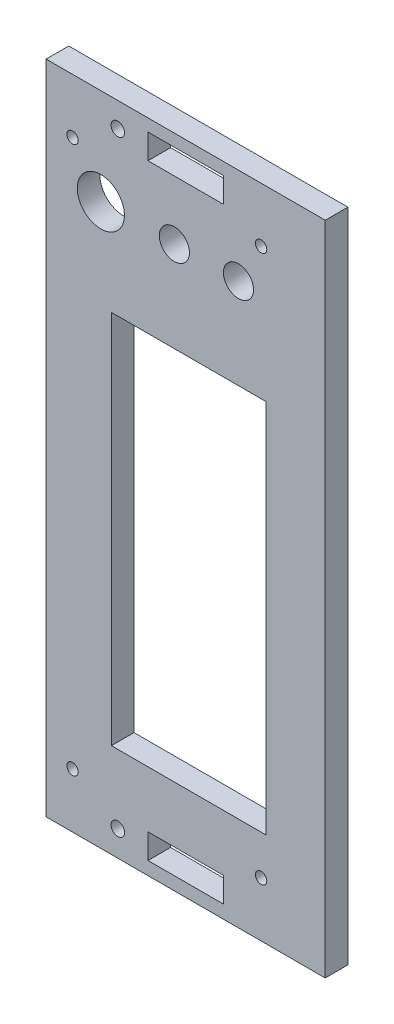
ISO-10303-21;
HEADER;
FILE_DESCRIPTION(('STEP AP214'),'2;1');
FILE_NAME('part.step','',(''),(''),'','','');
FILE_SCHEMA(('AUTOMOTIVE_DESIGN { 1 0 10303 214 1 1 1 1 }'));
ENDSEC;
DATA;
#1=APPLICATION_CONTEXT('core data for automotive mechanical design processes');
#2=APPLICATION_PROTOCOL_DEFINITION('international standard','automotive_design',2000,#1);
#3=PRODUCT_CONTEXT('',#1,'mechanical');
#4=PRODUCT('Part','Part','',(#3));
#5=PRODUCT_RELATED_PRODUCT_CATEGORY('part','',(#4));
#6=PRODUCT_DEFINITION_FORMATION('','',#4);
#7=PRODUCT_DEFINITION_CONTEXT('part definition',#1,'design');
#8=PRODUCT_DEFINITION('design','',#6,#7);
#9=PRODUCT_DEFINITION_SHAPE('','',#8);
#10=(LENGTH_UNIT() NAMED_UNIT(*) SI_UNIT(.MILLI.,.METRE.));
#11=(NAMED_UNIT(*) PLANE_ANGLE_UNIT() SI_UNIT($,.RADIAN.));
#12=(NAMED_UNIT(*) SI_UNIT($,.STERADIAN.) SOLID_ANGLE_UNIT());
#13=UNCERTAINTY_MEASURE_WITH_UNIT(LENGTH_MEASURE(1.E-05),#10,'distance_accuracy_value','');
#14=(GEOMETRIC_REPRESENTATION_CONTEXT(3) GLOBAL_UNCERTAINTY_ASSIGNED_CONTEXT((#13)) GLOBAL_UNIT_ASSIGNED_CONTEXT((#10,
#11,#12)) REPRESENTATION_CONTEXT('',''));
#15=CARTESIAN_POINT('',(0.,0.,0.));
#16=DIRECTION('',(0.,0.,1.));
#17=DIRECTION('',(1.,0.,0.));
#18=AXIS2_PLACEMENT_3D('',#15,#16,#17);
#19=CARTESIAN_POINT('',(0.,0.,6.));
#20=DIRECTION('',(0.,0.,1.));
#21=DIRECTION('',(1.,0.,0.));
#22=AXIS2_PLACEMENT_3D('',#19,#20,#21);
#23=PLANE('',#22);
#24=CARTESIAN_POINT('',(37.8220167653481,166.853545558465,6.));
#25=DIRECTION('',(0.,0.,1.));
#26=DIRECTION('',(1.,0.,0.));
#27=AXIS2_PLACEMENT_3D('',#24,#25,#26);
#28=CIRCLE('',#27,1.49999987999985);
#29=CARTESIAN_POINT('',(39.3220166453479,166.853545558465,6.));
#30=VERTEX_POINT('',#29);
#31=EDGE_CURVE('E255',#30,#30,#28,.T.);
#32=ORIENTED_EDGE('',*,*,#31,.F.);
#33=EDGE_LOOP('',(#32));
#34=FACE_BOUND('',#33,.T.);
#35=CARTESIAN_POINT('',(64.8220146053483,155.853546358465,6.));
#36=DIRECTION('',(0.,0.,1.));
#37=DIRECTION('',(1.,0.,0.));
#38=AXIS2_PLACEMENT_3D('',#35,#36,#37);
#39=CIRCLE('',#38,3.99999968000003);
#40=CARTESIAN_POINT('',(68.8220142853483,155.853546358465,6.));
#41=VERTEX_POINT('',#40);
#42=EDGE_CURVE('E267',#41,#41,#39,.T.);
#43=ORIENTED_EDGE('',*,*,#42,.F.);
#44=EDGE_LOOP('',(#43));
#45=FACE_BOUND('',#44,.T.);
#46=CARTESIAN_POINT('',(87.8220127653485,166.853545558465,6.));
#47=DIRECTION('',(0.,0.,1.));
#48=DIRECTION('',(1.,0.,0.));
#49=AXIS2_PLACEMENT_3D('',#46,#47,#48);
#50=CIRCLE('',#49,1.49999987999982);
#51=CARTESIAN_POINT('',(89.3220126453483,166.853545558465,6.));
#52=VERTEX_POINT('',#51);
#53=EDGE_CURVE('E279',#52,#52,#50,.T.);
#54=ORIENTED_EDGE('',*,*,#53,.F.);
#55=EDGE_LOOP('',(#54));
#56=FACE_BOUND('',#55,.T.);
#57=CARTESIAN_POINT('',(49.8220158053478,14.1317550915959,6.));
#58=DIRECTION('',(0.,0.,1.));
#59=DIRECTION('',(1.,0.,0.));
#60=AXIS2_PLACEMENT_3D('',#57,#58,#59);
#61=CIRCLE('',#60,1.79999985600005);
#62=CARTESIAN_POINT('',(51.6220156613478,14.1317550915959,6.));
#63=VERTEX_POINT('',#62);
#64=EDGE_CURVE('E291',#63,#63,#61,.T.);
#65=ORIENTED_EDGE('',*,*,#64,.F.);
#66=EDGE_LOOP('',(#65));
#67=FACE_BOUND('',#66,.T.);
#68=DIRECTION('',(-1.,0.,0.));
#69=VECTOR('',#68,1.);
#70=CARTESIAN_POINT('',(104.822011405349,181.353544398465,6.));
#71=LINE('',#70,#69);
#72=CARTESIAN_POINT('',(104.822011405349,181.353544398465,6.));
#73=VERTEX_POINT('',#72);
#74=CARTESIAN_POINT('',(30.822017325348,181.353544398465,6.));
#75=VERTEX_POINT('',#74);
#76=EDGE_CURVE('E303',#73,#75,#71,.T.);
#77=ORIENTED_EDGE('',*,*,#76,.T.);
#78=DIRECTION('',(0.,-1.,0.));
#79=VECTOR('',#78,1.);
#80=CARTESIAN_POINT('',(30.822017325348,181.353544398465,6.));
#81=LINE('',#80,#79);
#82=CARTESIAN_POINT('',(30.8220173253477,7.35355831846411,6.));
#83=VERTEX_POINT('',#82);
#84=EDGE_CURVE('E306',#75,#83,#81,.T.);
#85=ORIENTED_EDGE('',*,*,#84,.T.);
#86=DIRECTION('',(1.,0.,0.));
#87=VECTOR('',#86,1.);
#88=CARTESIAN_POINT('',(30.8220173253477,7.35355831846411,6.));
#89=LINE('',#88,#87);
#90=CARTESIAN_POINT('',(104.822011405348,7.35355831846394,6.));
#91=VERTEX_POINT('',#90);
#92=EDGE_CURVE('E309',#83,#91,#89,.T.);
#93=ORIENTED_EDGE('',*,*,#92,.T.);
#94=DIRECTION('',(0.,1.,0.));
#95=VECTOR('',#94,1.);
#96=CARTESIAN_POINT('',(104.822011405348,7.35355831846394,6.));
#97=LINE('',#96,#95);
#98=EDGE_CURVE('E311',#91,#73,#97,.T.);
#99=ORIENTED_EDGE('',*,*,#98,.T.);
#100=EDGE_LOOP('',(#77,#85,#93,#99));
#101=FACE_BOUND('',#100,.T.);
#102=CARTESIAN_POINT('',(87.8220127653481,21.8535571584638,6.));
#103=DIRECTION('',(0.,0.,1.));
#104=DIRECTION('',(1.,0.,0.));
#105=AXIS2_PLACEMENT_3D('',#102,#103,#104);
#106=CIRCLE('',#105,1.5);
#107=CARTESIAN_POINT('',(89.3220127653481,21.8535571584638,6.));
#108=VERTEX_POINT('',#107);
#109=EDGE_CURVE('E297',#108,#108,#106,.T.);
#110=ORIENTED_EDGE('',*,*,#109,.F.);
#111=EDGE_LOOP('',(#110));
#112=FACE_BOUND('',#111,.T.);
#113=CARTESIAN_POINT('',(37.8220167653477,21.8535571584639,6.));
#114=DIRECTION('',(0.,0.,1.));
#115=DIRECTION('',(1.,0.,0.));
#116=AXIS2_PLACEMENT_3D('',#113,#114,#115);
#117=CIRCLE('',#116,1.49999988000003);
#118=CARTESIAN_POINT('',(39.3220166453478,21.8535571584639,6.));
#119=VERTEX_POINT('',#118);
#120=EDGE_CURVE('E285',#119,#119,#117,.T.);
#121=ORIENTED_EDGE('',*,*,#120,.F.);
#122=EDGE_LOOP('',(#121));
#123=FACE_BOUND('',#122,.T.);
#124=CARTESIAN_POINT('',(81.8220132453484,155.853546358465,6.));
#125=DIRECTION('',(0.,0.,1.));
#126=DIRECTION('',(1.,0.,0.));
#127=AXIS2_PLACEMENT_3D('',#124,#125,#126);
#128=CIRCLE('',#127,3.99999968);
#129=CARTESIAN_POINT('',(85.8220129253484,155.853546358465,6.));
#130=VERTEX_POINT('',#129);
#131=EDGE_CURVE('E273',#130,#130,#128,.T.);
#132=ORIENTED_EDGE('',*,*,#131,.F.);
#133=EDGE_LOOP('',(#132));
#134=FACE_BOUND('',#133,.T.);
#135=CARTESIAN_POINT('',(45.3220161653481,155.853546358465,6.));
#136=DIRECTION('',(0.,0.,1.));
#137=DIRECTION('',(1.,0.,0.));
#138=AXIS2_PLACEMENT_3D('',#135,#136,#137);
#139=CIRCLE('',#138,6.24999950000005);
#140=CARTESIAN_POINT('',(51.5720156653482,155.853546358465,6.));
#141=VERTEX_POINT('',#140);
#142=EDGE_CURVE('E261',#141,#141,#139,.T.);
#143=ORIENTED_EDGE('',*,*,#142,.F.);
#144=EDGE_LOOP('',(#143));
#145=FACE_BOUND('',#144,.T.);
#146=CARTESIAN_POINT('',(49.8220158053482,174.808809716546,6.));
#147=DIRECTION('',(0.,0.,1.));
#148=DIRECTION('',(1.,0.,0.));
#149=AXIS2_PLACEMENT_3D('',#146,#147,#148);
#150=CIRCLE('',#149,1.79999985599997);
#151=CARTESIAN_POINT('',(51.6220156613482,174.808809716546,6.));
#152=VERTEX_POINT('',#151);
#153=EDGE_CURVE('E249',#152,#152,#150,.T.);
#154=ORIENTED_EDGE('',*,*,#153,.F.);
#155=EDGE_LOOP('',(#154));
#156=FACE_BOUND('',#155,.T.);
#157=DIRECTION('',(-1.,0.,0.));
#158=VECTOR('',#157,1.);
#159=CARTESIAN_POINT('',(89.1220126613484,131.853548358465,6.));
#160=LINE('',#159,#158);
#161=CARTESIAN_POINT('',(89.1220126613484,131.853548358465,6.));
#162=VERTEX_POINT('',#161);
#163=CARTESIAN_POINT('',(48.122015941348,131.853548358465,6.));
#164=VERTEX_POINT('',#163);
#165=EDGE_CURVE('E220',#162,#164,#160,.T.);
#166=ORIENTED_EDGE('',*,*,#165,.F.);
#167=DIRECTION('',(0.,1.,0.));
#168=VECTOR('',#167,1.);
#169=CARTESIAN_POINT('',(89.1220126613482,32.3535563184641,6.));
#170=LINE('',#169,#168);
#171=CARTESIAN_POINT('',(89.1220126613482,32.3535563184641,6.));
#172=VERTEX_POINT('',#171);
#173=EDGE_CURVE('E218',#172,#162,#170,.T.);
#174=ORIENTED_EDGE('',*,*,#173,.F.);
#175=DIRECTION('',(1.,0.,0.));
#176=VECTOR('',#175,1.);
#177=CARTESIAN_POINT('',(48.1220159413478,32.3535563184641,6.));
#178=LINE('',#177,#176);
#179=CARTESIAN_POINT('',(48.1220159413478,32.3535563184641,6.));
#180=VERTEX_POINT('',#179);
#181=EDGE_CURVE('E226',#180,#172,#178,.T.);
#182=ORIENTED_EDGE('',*,*,#181,.F.);
#183=DIRECTION('',(0.,-1.,0.));
#184=VECTOR('',#183,1.);
#185=CARTESIAN_POINT('',(48.122015941348,131.853548358465,6.));
#186=LINE('',#185,#184);
#187=EDGE_CURVE('E223',#164,#180,#186,.T.);
#188=ORIENTED_EDGE('',*,*,#187,.F.);
#189=EDGE_LOOP('',(#166,#174,#182,#188));
#190=FACE_BOUND('',#189,.T.);
#191=DIRECTION('',(0.,-1.,0.));
#192=VECTOR('',#191,1.);
#193=CARTESIAN_POINT('',(57.8220172467975,17.4317557862455,6.));
#194=LINE('',#193,#192);
#195=CARTESIAN_POINT('',(57.8220172467975,17.4317557862455,6.));
#196=VERTEX_POINT('',#195);
#197=CARTESIAN_POINT('',(57.8220172467975,10.8317543969464,6.));
#198=VERTEX_POINT('',#197);
#199=EDGE_CURVE('E189',#196,#198,#194,.T.);
#200=ORIENTED_EDGE('',*,*,#199,.F.);
#201=DIRECTION('',(-1.,0.,0.));
#202=VECTOR('',#201,1.);
#203=CARTESIAN_POINT('',(77.8220114838981,17.4317557862455,6.));
#204=LINE('',#203,#202);
#205=CARTESIAN_POINT('',(77.8220114838981,17.4317557862455,6.));
#206=VERTEX_POINT('',#205);
#207=EDGE_CURVE('E187',#206,#196,#204,.T.);
#208=ORIENTED_EDGE('',*,*,#207,.F.);
#209=DIRECTION('',(0.,1.,0.));
#210=VECTOR('',#209,1.);
#211=CARTESIAN_POINT('',(77.8220114838984,10.8317543969464,6.));
#212=LINE('',#211,#210);
#213=CARTESIAN_POINT('',(77.8220114838984,10.8317543969464,6.));
#214=VERTEX_POINT('',#213);
#215=EDGE_CURVE('E195',#214,#206,#212,.T.);
#216=ORIENTED_EDGE('',*,*,#215,.F.);
#217=DIRECTION('',(1.,0.,0.));
#218=VECTOR('',#217,1.);
#219=CARTESIAN_POINT('',(57.8220172467975,10.8317543969464,6.));
#220=LINE('',#219,#218);
#221=EDGE_CURVE('E192',#198,#214,#220,.T.);
#222=ORIENTED_EDGE('',*,*,#221,.F.);
#223=EDGE_LOOP('',(#200,#208,#216,#222));
#224=FACE_BOUND('',#223,.T.);
#225=DIRECTION('',(0.,1.,0.));
#226=VECTOR('',#225,1.);
#227=CARTESIAN_POINT('',(77.8220114838988,171.508809021897,6.));
#228=LINE('',#227,#226);
#229=CARTESIAN_POINT('',(77.8220114838988,171.508809021897,6.));
#230=VERTEX_POINT('',#229);
#231=CARTESIAN_POINT('',(77.8220114838986,178.108810411196,6.));
#232=VERTEX_POINT('',#231);
#233=EDGE_CURVE('E159',#230,#232,#228,.T.);
#234=ORIENTED_EDGE('',*,*,#233,.F.);
#235=DIRECTION('',(1.,0.,0.));
#236=VECTOR('',#235,1.);
#237=CARTESIAN_POINT('',(57.8220172467981,171.508809021897,6.));
#238=LINE('',#237,#236);
#239=CARTESIAN_POINT('',(57.8220172467981,171.508809021897,6.));
#240=VERTEX_POINT('',#239);
#241=EDGE_CURVE('E151',#240,#230,#238,.T.);
#242=ORIENTED_EDGE('',*,*,#241,.F.);
#243=DIRECTION('',(0.,-1.,0.));
#244=VECTOR('',#243,1.);
#245=CARTESIAN_POINT('',(57.8220172467981,178.108810411196,6.));
#246=LINE('',#245,#244);
#247=CARTESIAN_POINT('',(57.8220172467981,178.108810411196,6.));
#248=VERTEX_POINT('',#247);
#249=EDGE_CURVE('E173',#248,#240,#246,.T.);
#250=ORIENTED_EDGE('',*,*,#249,.F.);
#251=DIRECTION('',(-1.,0.,0.));
#252=VECTOR('',#251,1.);
#253=CARTESIAN_POINT('',(77.8220114838986,178.108810411196,6.));
#254=LINE('',#253,#252);
#255=EDGE_CURVE('E171',#232,#248,#254,.T.);
#256=ORIENTED_EDGE('',*,*,#255,.F.);
#257=EDGE_LOOP('',(#234,#242,#250,#256));
#258=FACE_BOUND('',#257,.T.);
#259=ADVANCED_FACE('F38',(#34,#45,#56,#67,#101,#112,#123,#134,#145,#156,#190,#224,#258),#23,.T.);
#260=CARTESIAN_POINT('',(0.,0.,0.));
#261=DIRECTION('',(0.,0.,1.));
#262=DIRECTION('',(1.,0.,0.));
#263=AXIS2_PLACEMENT_3D('',#260,#261,#262);
#264=PLANE('',#263);
#265=DIRECTION('',(-1.,0.,0.));
#266=VECTOR('',#265,1.);
#267=CARTESIAN_POINT('',(77.8220114838981,17.4317557862455,0.));
#268=LINE('',#267,#266);
#269=CARTESIAN_POINT('',(77.8220114838981,17.4317557862455,0.));
#270=VERTEX_POINT('',#269);
#271=CARTESIAN_POINT('',(57.8220172467975,17.4317557862455,0.));
#272=VERTEX_POINT('',#271);
#273=EDGE_CURVE('E167',#270,#272,#268,.T.);
#274=ORIENTED_EDGE('',*,*,#273,.T.);
#275=DIRECTION('',(0.,-1.,0.));
#276=VECTOR('',#275,1.);
#277=CARTESIAN_POINT('',(57.8220172467975,17.4317557862455,0.));
#278=LINE('',#277,#276);
#279=CARTESIAN_POINT('',(57.8220172467975,10.8317543969464,0.));
#280=VERTEX_POINT('',#279);
#281=EDGE_CURVE('E200',#272,#280,#278,.T.);
#282=ORIENTED_EDGE('',*,*,#281,.T.);
#283=DIRECTION('',(1.,0.,0.));
#284=VECTOR('',#283,1.);
#285=CARTESIAN_POINT('',(57.8220172467975,10.8317543969464,0.));
#286=LINE('',#285,#284);
#287=CARTESIAN_POINT('',(77.8220114838984,10.8317543969464,0.));
#288=VERTEX_POINT('',#287);
#289=EDGE_CURVE('E203',#280,#288,#286,.T.);
#290=ORIENTED_EDGE('',*,*,#289,.T.);
#291=DIRECTION('',(0.,1.,0.));
#292=VECTOR('',#291,1.);
#293=CARTESIAN_POINT('',(77.8220114838984,10.8317543969464,0.));
#294=LINE('',#293,#292);
#295=EDGE_CURVE('E190',#288,#270,#294,.T.);
#296=ORIENTED_EDGE('',*,*,#295,.T.);
#297=EDGE_LOOP('',(#274,#282,#290,#296));
#298=FACE_BOUND('',#297,.T.);
#299=CARTESIAN_POINT('',(49.8220158053482,174.808809716546,0.));
#300=DIRECTION('',(0.,0.,1.));
#301=DIRECTION('',(1.,0.,0.));
#302=AXIS2_PLACEMENT_3D('',#299,#300,#301);
#303=CIRCLE('',#302,1.79999985599997);
#304=CARTESIAN_POINT('',(51.6220156613482,174.808809716546,0.));
#305=VERTEX_POINT('',#304);
#306=EDGE_CURVE('E248',#305,#305,#303,.T.);
#307=ORIENTED_EDGE('',*,*,#306,.T.);
#308=EDGE_LOOP('',(#307));
#309=FACE_BOUND('',#308,.T.);
#310=CARTESIAN_POINT('',(37.8220167653481,166.853545558465,0.));
#311=DIRECTION('',(0.,0.,1.));
#312=DIRECTION('',(1.,0.,0.));
#313=AXIS2_PLACEMENT_3D('',#310,#311,#312);
#314=CIRCLE('',#313,1.49999987999985);
#315=CARTESIAN_POINT('',(39.3220166453479,166.853545558465,0.));
#316=VERTEX_POINT('',#315);
#317=EDGE_CURVE('E252',#316,#316,#314,.T.);
#318=ORIENTED_EDGE('',*,*,#317,.T.);
#319=EDGE_LOOP('',(#318));
#320=FACE_BOUND('',#319,.T.);
#321=CARTESIAN_POINT('',(45.3220161653481,155.853546358465,0.));
#322=DIRECTION('',(0.,0.,1.));
#323=DIRECTION('',(1.,0.,0.));
#324=AXIS2_PLACEMENT_3D('',#321,#322,#323);
#325=CIRCLE('',#324,6.24999950000005);
#326=CARTESIAN_POINT('',(51.5720156653482,155.853546358465,0.));
#327=VERTEX_POINT('',#326);
#328=EDGE_CURVE('E258',#327,#327,#325,.T.);
#329=ORIENTED_EDGE('',*,*,#328,.T.);
#330=EDGE_LOOP('',(#329));
#331=FACE_BOUND('',#330,.T.);
#332=CARTESIAN_POINT('',(64.8220146053483,155.853546358465,0.));
#333=DIRECTION('',(0.,0.,1.));
#334=DIRECTION('',(1.,0.,0.));
#335=AXIS2_PLACEMENT_3D('',#332,#333,#334);
#336=CIRCLE('',#335,3.99999968000003);
#337=CARTESIAN_POINT('',(68.8220142853483,155.853546358465,0.));
#338=VERTEX_POINT('',#337);
#339=EDGE_CURVE('E264',#338,#338,#336,.T.);
#340=ORIENTED_EDGE('',*,*,#339,.T.);
#341=EDGE_LOOP('',(#340));
#342=FACE_BOUND('',#341,.T.);
#343=CARTESIAN_POINT('',(81.8220132453484,155.853546358465,0.));
#344=DIRECTION('',(0.,0.,1.));
#345=DIRECTION('',(1.,0.,0.));
#346=AXIS2_PLACEMENT_3D('',#343,#344,#345);
#347=CIRCLE('',#346,3.99999968);
#348=CARTESIAN_POINT('',(85.8220129253484,155.853546358465,0.));
#349=VERTEX_POINT('',#348);
#350=EDGE_CURVE('E270',#349,#349,#347,.T.);
#351=ORIENTED_EDGE('',*,*,#350,.T.);
#352=EDGE_LOOP('',(#351));
#353=FACE_BOUND('',#352,.T.);
#354=CARTESIAN_POINT('',(87.8220127653485,166.853545558465,0.));
#355=DIRECTION('',(0.,0.,1.));
#356=DIRECTION('',(1.,0.,0.));
#357=AXIS2_PLACEMENT_3D('',#354,#355,#356);
#358=CIRCLE('',#357,1.49999987999982);
#359=CARTESIAN_POINT('',(89.3220126453483,166.853545558465,0.));
#360=VERTEX_POINT('',#359);
#361=EDGE_CURVE('E276',#360,#360,#358,.T.);
#362=ORIENTED_EDGE('',*,*,#361,.T.);
#363=EDGE_LOOP('',(#362));
#364=FACE_BOUND('',#363,.T.);
#365=CARTESIAN_POINT('',(37.8220167653477,21.8535571584639,0.));
#366=DIRECTION('',(0.,0.,1.));
#367=DIRECTION('',(1.,0.,0.));
#368=AXIS2_PLACEMENT_3D('',#365,#366,#367);
#369=CIRCLE('',#368,1.49999988000003);
#370=CARTESIAN_POINT('',(39.3220166453478,21.8535571584639,0.));
#371=VERTEX_POINT('',#370);
#372=EDGE_CURVE('E282',#371,#371,#369,.T.);
#373=ORIENTED_EDGE('',*,*,#372,.T.);
#374=EDGE_LOOP('',(#373));
#375=FACE_BOUND('',#374,.T.);
#376=CARTESIAN_POINT('',(49.8220158053478,14.1317550915959,0.));
#377=DIRECTION('',(0.,0.,1.));
#378=DIRECTION('',(1.,0.,0.));
#379=AXIS2_PLACEMENT_3D('',#376,#377,#378);
#380=CIRCLE('',#379,1.79999985600005);
#381=CARTESIAN_POINT('',(51.6220156613478,14.1317550915959,0.));
#382=VERTEX_POINT('',#381);
#383=EDGE_CURVE('E288',#382,#382,#380,.T.);
#384=ORIENTED_EDGE('',*,*,#383,.T.);
#385=EDGE_LOOP('',(#384));
#386=FACE_BOUND('',#385,.T.);
#387=CARTESIAN_POINT('',(87.8220127653481,21.8535571584638,0.));
#388=DIRECTION('',(0.,0.,1.));
#389=DIRECTION('',(1.,0.,0.));
#390=AXIS2_PLACEMENT_3D('',#387,#388,#389);
#391=CIRCLE('',#390,1.5);
#392=CARTESIAN_POINT('',(89.3220127653481,21.8535571584638,0.));
#393=VERTEX_POINT('',#392);
#394=EDGE_CURVE('E294',#393,#393,#391,.T.);
#395=ORIENTED_EDGE('',*,*,#394,.T.);
#396=EDGE_LOOP('',(#395));
#397=FACE_BOUND('',#396,.T.);
#398=DIRECTION('',(-1.,0.,0.));
#399=VECTOR('',#398,1.);
#400=CARTESIAN_POINT('',(104.822011405349,181.353544398465,0.));
#401=LINE('',#400,#399);
#402=CARTESIAN_POINT('',(104.822011405349,181.353544398465,0.));
#403=VERTEX_POINT('',#402);
#404=CARTESIAN_POINT('',(30.822017325348,181.353544398465,0.));
#405=VERTEX_POINT('',#404);
#406=EDGE_CURVE('E300',#403,#405,#401,.T.);
#407=ORIENTED_EDGE('',*,*,#406,.F.);
#408=DIRECTION('',(0.,1.,0.));
#409=VECTOR('',#408,1.);
#410=CARTESIAN_POINT('',(104.822011405348,7.35355831846394,0.));
#411=LINE('',#410,#409);
#412=CARTESIAN_POINT('',(104.822011405348,7.35355831846394,0.));
#413=VERTEX_POINT('',#412);
#414=EDGE_CURVE('E307',#413,#403,#411,.T.);
#415=ORIENTED_EDGE('',*,*,#414,.F.);
#416=DIRECTION('',(1.,0.,0.));
#417=VECTOR('',#416,1.);
#418=CARTESIAN_POINT('',(30.8220173253477,7.35355831846411,0.));
#419=LINE('',#418,#417);
#420=CARTESIAN_POINT('',(30.8220173253477,7.35355831846411,0.));
#421=VERTEX_POINT('',#420);
#422=EDGE_CURVE('E318',#421,#413,#419,.T.);
#423=ORIENTED_EDGE('',*,*,#422,.F.);
#424=DIRECTION('',(0.,-1.,0.));
#425=VECTOR('',#424,1.);
#426=CARTESIAN_POINT('',(30.822017325348,181.353544398465,0.));
#427=LINE('',#426,#425);
#428=EDGE_CURVE('E316',#405,#421,#427,.T.);
#429=ORIENTED_EDGE('',*,*,#428,.F.);
#430=EDGE_LOOP('',(#407,#415,#423,#429));
#431=FACE_BOUND('',#430,.T.);
#432=DIRECTION('',(0.,1.,0.));
#433=VECTOR('',#432,1.);
#434=CARTESIAN_POINT('',(89.1220126613482,32.3535563184641,0.));
#435=LINE('',#434,#433);
#436=CARTESIAN_POINT('',(89.1220126613482,32.3535563184641,0.));
#437=VERTEX_POINT('',#436);
#438=CARTESIAN_POINT('',(89.1220126613484,131.853548358465,0.));
#439=VERTEX_POINT('',#438);
#440=EDGE_CURVE('E217',#437,#439,#435,.T.);
#441=ORIENTED_EDGE('',*,*,#440,.T.);
#442=DIRECTION('',(-1.,0.,0.));
#443=VECTOR('',#442,1.);
#444=CARTESIAN_POINT('',(89.1220126613484,131.853548358465,0.));
#445=LINE('',#444,#443);
#446=CARTESIAN_POINT('',(48.122015941348,131.853548358465,0.));
#447=VERTEX_POINT('',#446);
#448=EDGE_CURVE('E231',#439,#447,#445,.T.);
#449=ORIENTED_EDGE('',*,*,#448,.T.);
#450=DIRECTION('',(0.,-1.,0.));
#451=VECTOR('',#450,1.);
#452=CARTESIAN_POINT('',(48.122015941348,131.853548358465,0.));
#453=LINE('',#452,#451);
#454=CARTESIAN_POINT('',(48.1220159413478,32.3535563184641,0.));
#455=VERTEX_POINT('',#454);
#456=EDGE_CURVE('E234',#447,#455,#453,.T.);
#457=ORIENTED_EDGE('',*,*,#456,.T.);
#458=DIRECTION('',(1.,0.,0.));
#459=VECTOR('',#458,1.);
#460=CARTESIAN_POINT('',(48.1220159413478,32.3535563184641,0.));
#461=LINE('',#460,#459);
#462=EDGE_CURVE('E221',#455,#437,#461,.T.);
#463=ORIENTED_EDGE('',*,*,#462,.T.);
#464=EDGE_LOOP('',(#441,#449,#457,#463));
#465=FACE_BOUND('',#464,.T.);
#466=DIRECTION('',(1.,0.,0.));
#467=VECTOR('',#466,1.);
#468=CARTESIAN_POINT('',(57.8220172467981,171.508809021897,0.));
#469=LINE('',#468,#467);
#470=CARTESIAN_POINT('',(57.8220172467981,171.508809021897,0.));
#471=VERTEX_POINT('',#470);
#472=CARTESIAN_POINT('',(77.8220114838988,171.508809021897,0.));
#473=VERTEX_POINT('',#472);
#474=EDGE_CURVE('E61',#471,#473,#469,.T.);
#475=ORIENTED_EDGE('',*,*,#474,.T.);
#476=DIRECTION('',(0.,1.,0.));
#477=VECTOR('',#476,1.);
#478=CARTESIAN_POINT('',(77.8220114838988,171.508809021897,0.));
#479=LINE('',#478,#477);
#480=CARTESIAN_POINT('',(77.8220114838986,178.108810411196,0.));
#481=VERTEX_POINT('',#480);
#482=EDGE_CURVE('E166',#473,#481,#479,.T.);
#483=ORIENTED_EDGE('',*,*,#482,.T.);
#484=DIRECTION('',(-1.,0.,0.));
#485=VECTOR('',#484,1.);
#486=CARTESIAN_POINT('',(77.8220114838986,178.108810411196,0.));
#487=LINE('',#486,#485);
#488=CARTESIAN_POINT('',(57.8220172467981,178.108810411196,0.));
#489=VERTEX_POINT('',#488);
#490=EDGE_CURVE('E179',#481,#489,#487,.T.);
#491=ORIENTED_EDGE('',*,*,#490,.T.);
#492=DIRECTION('',(0.,-1.,0.));
#493=VECTOR('',#492,1.);
#494=CARTESIAN_POINT('',(57.8220172467981,178.108810411196,0.));
#495=LINE('',#494,#493);
#496=EDGE_CURVE('E160',#489,#471,#495,.T.);
#497=ORIENTED_EDGE('',*,*,#496,.T.);
#498=EDGE_LOOP('',(#475,#483,#491,#497));
#499=FACE_BOUND('',#498,.T.);
#500=ADVANCED_FACE('F336',(#298,#309,#320,#331,#342,#353,#364,#375,#386,#397,#431,#465,#499),
#264,.F.);
#501=CARTESIAN_POINT('',(104.822011405349,181.353544398465,6.));
#502=DIRECTION('',(0.,-1.,0.));
#503=DIRECTION('',(1.,0.,0.));
#504=AXIS2_PLACEMENT_3D('',#501,#502,#503);
#505=PLANE('',#504);
#506=ORIENTED_EDGE('',*,*,#406,.T.);
#507=DIRECTION('',(0.,0.,-1.));
#508=VECTOR('',#507,1.);
#509=CARTESIAN_POINT('',(30.822017325348,181.353544398465,6.));
#510=LINE('',#509,#508);
#511=EDGE_CURVE('E11',#75,#405,#510,.T.);
#512=ORIENTED_EDGE('',*,*,#511,.F.);
#513=ORIENTED_EDGE('',*,*,#76,.F.);
#514=DIRECTION('',(0.,0.,-1.));
#515=VECTOR('',#514,1.);
#516=CARTESIAN_POINT('',(104.822011405349,181.353544398465,6.));
#517=LINE('',#516,#515);
#518=EDGE_CURVE('E313',#73,#403,#517,.T.);
#519=ORIENTED_EDGE('',*,*,#518,.T.);
#520=EDGE_LOOP('',(#506,#512,#513,#519));
#521=FACE_BOUND('',#520,.T.);
#522=ADVANCED_FACE('F40',(#521),#505,.F.);
#523=CARTESIAN_POINT('',(30.822017325348,181.353544398465,6.));
#524=DIRECTION('',(1.,0.,0.));
#525=DIRECTION('',(0.,1.,0.));
#526=AXIS2_PLACEMENT_3D('',#523,#524,#525);
#527=PLANE('',#526);
#528=ORIENTED_EDGE('',*,*,#428,.T.);
#529=DIRECTION('',(0.,0.,-1.));
#530=VECTOR('',#529,1.);
#531=CARTESIAN_POINT('',(30.8220173253477,7.35355831846411,6.));
#532=LINE('',#531,#530);
#533=EDGE_CURVE('E46',#83,#421,#532,.T.);
#534=ORIENTED_EDGE('',*,*,#533,.F.);
#535=ORIENTED_EDGE('',*,*,#84,.F.);
#536=ORIENTED_EDGE('',*,*,#511,.T.);
#537=EDGE_LOOP('',(#528,#534,#535,#536));
#538=FACE_BOUND('',#537,.T.);
#539=ADVANCED_FACE('F347',(#538),#527,.F.);
#540=CARTESIAN_POINT('',(30.8220173253477,7.35355831846411,6.));
#541=DIRECTION('',(0.,1.,0.));
#542=DIRECTION('',(-1.,0.,0.));
#543=AXIS2_PLACEMENT_3D('',#540,#541,#542);
#544=PLANE('',#543);
#545=ORIENTED_EDGE('',*,*,#422,.T.);
#546=DIRECTION('',(0.,0.,-1.));
#547=VECTOR('',#546,1.);
#548=CARTESIAN_POINT('',(104.822011405348,7.35355831846394,6.));
#549=LINE('',#548,#547);
#550=EDGE_CURVE('E323',#91,#413,#549,.T.);
#551=ORIENTED_EDGE('',*,*,#550,.F.);
#552=ORIENTED_EDGE('',*,*,#92,.F.);
#553=ORIENTED_EDGE('',*,*,#533,.T.);
#554=EDGE_LOOP('',(#545,#551,#552,#553));
#555=FACE_BOUND('',#554,.T.);
#556=ADVANCED_FACE('F330',(#555),#544,.F.);
#557=CARTESIAN_POINT('',(104.822011405348,7.35355831846394,6.));
#558=DIRECTION('',(-1.,0.,0.));
#559=DIRECTION('',(0.,-1.,0.));
#560=AXIS2_PLACEMENT_3D('',#557,#558,#559);
#561=PLANE('',#560);
#562=ORIENTED_EDGE('',*,*,#414,.T.);
#563=ORIENTED_EDGE('',*,*,#518,.F.);
#564=ORIENTED_EDGE('',*,*,#98,.F.);
#565=ORIENTED_EDGE('',*,*,#550,.T.);
#566=EDGE_LOOP('',(#562,#563,#564,#565));
#567=FACE_BOUND('',#566,.T.);
#568=ADVANCED_FACE('F340',(#567),#561,.F.);
#569=CARTESIAN_POINT('',(87.8220127653481,21.8535571584638,6.));
#570=DIRECTION('',(0.,0.,-1.));
#571=DIRECTION('',(-1.,0.,0.));
#572=AXIS2_PLACEMENT_3D('',#569,#570,#571);
#573=CYLINDRICAL_SURFACE('',#572,1.5);
#574=ORIENTED_EDGE('',*,*,#109,.T.);
#575=EDGE_LOOP('',(#574));
#576=FACE_BOUND('',#575,.T.);
#577=ORIENTED_EDGE('',*,*,#394,.F.);
#578=EDGE_LOOP('',(#577));
#579=FACE_BOUND('',#578,.T.);
#580=ADVANCED_FACE('F364',(#576,#579),#573,.F.);
#581=CARTESIAN_POINT('',(49.8220158053478,14.1317550915959,6.));
#582=DIRECTION('',(0.,0.,-1.));
#583=DIRECTION('',(-1.,0.,0.));
#584=AXIS2_PLACEMENT_3D('',#581,#582,#583);
#585=CYLINDRICAL_SURFACE('',#584,1.79999985600005);
#586=ORIENTED_EDGE('',*,*,#64,.T.);
#587=EDGE_LOOP('',(#586));
#588=FACE_BOUND('',#587,.T.);
#589=ORIENTED_EDGE('',*,*,#383,.F.);
#590=EDGE_LOOP('',(#589));
#591=FACE_BOUND('',#590,.T.);
#592=ADVANCED_FACE('F371',(#588,#591),#585,.F.);
#593=CARTESIAN_POINT('',(37.8220167653477,21.8535571584639,6.));
#594=DIRECTION('',(0.,0.,-1.));
#595=DIRECTION('',(-1.,0.,0.));
#596=AXIS2_PLACEMENT_3D('',#593,#594,#595);
#597=CYLINDRICAL_SURFACE('',#596,1.49999988000003);
#598=ORIENTED_EDGE('',*,*,#120,.T.);
#599=EDGE_LOOP('',(#598));
#600=FACE_BOUND('',#599,.T.);
#601=ORIENTED_EDGE('',*,*,#372,.F.);
#602=EDGE_LOOP('',(#601));
#603=FACE_BOUND('',#602,.T.);
#604=ADVANCED_FACE('F376',(#600,#603),#597,.F.);
#605=CARTESIAN_POINT('',(87.8220127653485,166.853545558465,6.));
#606=DIRECTION('',(0.,0.,-1.));
#607=DIRECTION('',(-1.,0.,0.));
#608=AXIS2_PLACEMENT_3D('',#605,#606,#607);
#609=CYLINDRICAL_SURFACE('',#608,1.49999987999982);
#610=ORIENTED_EDGE('',*,*,#53,.T.);
#611=EDGE_LOOP('',(#610));
#612=FACE_BOUND('',#611,.T.);
#613=ORIENTED_EDGE('',*,*,#361,.F.);
#614=EDGE_LOOP('',(#613));
#615=FACE_BOUND('',#614,.T.);
#616=ADVANCED_FACE('F462',(#612,#615),#609,.F.);
#617=CARTESIAN_POINT('',(81.8220132453484,155.853546358465,6.));
#618=DIRECTION('',(0.,0.,-1.));
#619=DIRECTION('',(-1.,0.,0.));
#620=AXIS2_PLACEMENT_3D('',#617,#618,#619);
#621=CYLINDRICAL_SURFACE('',#620,3.99999968);
#622=ORIENTED_EDGE('',*,*,#131,.T.);
#623=EDGE_LOOP('',(#622));
#624=FACE_BOUND('',#623,.T.);
#625=ORIENTED_EDGE('',*,*,#350,.F.);
#626=EDGE_LOOP('',(#625));
#627=FACE_BOUND('',#626,.T.);
#628=ADVANCED_FACE('F458',(#624,#627),#621,.F.);
#629=CARTESIAN_POINT('',(64.8220146053483,155.853546358465,6.));
#630=DIRECTION('',(0.,0.,-1.));
#631=DIRECTION('',(-1.,0.,0.));
#632=AXIS2_PLACEMENT_3D('',#629,#630,#631);
#633=CYLINDRICAL_SURFACE('',#632,3.99999968000003);
#634=ORIENTED_EDGE('',*,*,#42,.T.);
#635=EDGE_LOOP('',(#634));
#636=FACE_BOUND('',#635,.T.);
#637=ORIENTED_EDGE('',*,*,#339,.F.);
#638=EDGE_LOOP('',(#637));
#639=FACE_BOUND('',#638,.T.);
#640=ADVANCED_FACE('F454',(#636,#639),#633,.F.);
#641=CARTESIAN_POINT('',(45.3220161653481,155.853546358465,6.));
#642=DIRECTION('',(0.,0.,-1.));
#643=DIRECTION('',(-1.,0.,0.));
#644=AXIS2_PLACEMENT_3D('',#641,#642,#643);
#645=CYLINDRICAL_SURFACE('',#644,6.24999950000005);
#646=ORIENTED_EDGE('',*,*,#142,.T.);
#647=EDGE_LOOP('',(#646));
#648=FACE_BOUND('',#647,.T.);
#649=ORIENTED_EDGE('',*,*,#328,.F.);
#650=EDGE_LOOP('',(#649));
#651=FACE_BOUND('',#650,.T.);
#652=ADVANCED_FACE('F450',(#648,#651),#645,.F.);
#653=CARTESIAN_POINT('',(37.8220167653481,166.853545558465,6.));
#654=DIRECTION('',(0.,0.,-1.));
#655=DIRECTION('',(-1.,0.,0.));
#656=AXIS2_PLACEMENT_3D('',#653,#654,#655);
#657=CYLINDRICAL_SURFACE('',#656,1.49999987999985);
#658=ORIENTED_EDGE('',*,*,#31,.T.);
#659=EDGE_LOOP('',(#658));
#660=FACE_BOUND('',#659,.T.);
#661=ORIENTED_EDGE('',*,*,#317,.F.);
#662=EDGE_LOOP('',(#661));
#663=FACE_BOUND('',#662,.T.);
#664=ADVANCED_FACE('F446',(#660,#663),#657,.F.);
#665=CARTESIAN_POINT('',(49.8220158053482,174.808809716546,6.));
#666=DIRECTION('',(0.,0.,-1.));
#667=DIRECTION('',(-1.,0.,0.));
#668=AXIS2_PLACEMENT_3D('',#665,#666,#667);
#669=CYLINDRICAL_SURFACE('',#668,1.79999985599997);
#670=ORIENTED_EDGE('',*,*,#153,.T.);
#671=EDGE_LOOP('',(#670));
#672=FACE_BOUND('',#671,.T.);
#673=ORIENTED_EDGE('',*,*,#306,.F.);
#674=EDGE_LOOP('',(#673));
#675=FACE_BOUND('',#674,.T.);
#676=ADVANCED_FACE('F442',(#672,#675),#669,.F.);
#677=CARTESIAN_POINT('',(89.1220126613482,32.3535563184641,6.));
#678=DIRECTION('',(-1.,0.,0.));
#679=DIRECTION('',(0.,-1.,0.));
#680=AXIS2_PLACEMENT_3D('',#677,#678,#679);
#681=PLANE('',#680);
#682=ORIENTED_EDGE('',*,*,#440,.F.);
#683=DIRECTION('',(0.,0.,-1.));
#684=VECTOR('',#683,1.);
#685=CARTESIAN_POINT('',(89.1220126613482,32.3535563184641,6.));
#686=LINE('',#685,#684);
#687=EDGE_CURVE('E228',#172,#437,#686,.T.);
#688=ORIENTED_EDGE('',*,*,#687,.F.);
#689=ORIENTED_EDGE('',*,*,#173,.T.);
#690=DIRECTION('',(0.,0.,-1.));
#691=VECTOR('',#690,1.);
#692=CARTESIAN_POINT('',(89.1220126613484,131.853548358465,6.));
#693=LINE('',#692,#691);
#694=EDGE_CURVE('E245',#162,#439,#693,.T.);
#695=ORIENTED_EDGE('',*,*,#694,.T.);
#696=EDGE_LOOP('',(#682,#688,#689,#695));
#697=FACE_BOUND('',#696,.T.);
#698=ADVANCED_FACE('F438',(#697),#681,.T.);
#699=CARTESIAN_POINT('',(89.1220126613484,131.853548358465,6.));
#700=DIRECTION('',(0.,-1.,0.));
#701=DIRECTION('',(1.,0.,0.));
#702=AXIS2_PLACEMENT_3D('',#699,#700,#701);
#703=PLANE('',#702);
#704=ORIENTED_EDGE('',*,*,#448,.F.);
#705=ORIENTED_EDGE('',*,*,#694,.F.);
#706=ORIENTED_EDGE('',*,*,#165,.T.);
#707=DIRECTION('',(0.,0.,-1.));
#708=VECTOR('',#707,1.);
#709=CARTESIAN_POINT('',(48.122015941348,131.853548358465,6.));
#710=LINE('',#709,#708);
#711=EDGE_CURVE('E243',#164,#447,#710,.T.);
#712=ORIENTED_EDGE('',*,*,#711,.T.);
#713=EDGE_LOOP('',(#704,#705,#706,#712));
#714=FACE_BOUND('',#713,.T.);
#715=ADVANCED_FACE('F434',(#714),#703,.T.);
#716=CARTESIAN_POINT('',(48.122015941348,131.853548358465,6.));
#717=DIRECTION('',(1.,0.,0.));
#718=DIRECTION('',(0.,1.,0.));
#719=AXIS2_PLACEMENT_3D('',#716,#717,#718);
#720=PLANE('',#719);
#721=ORIENTED_EDGE('',*,*,#456,.F.);
#722=ORIENTED_EDGE('',*,*,#711,.F.);
#723=ORIENTED_EDGE('',*,*,#187,.T.);
#724=DIRECTION('',(0.,0.,-1.));
#725=VECTOR('',#724,1.);
#726=CARTESIAN_POINT('',(48.1220159413478,32.3535563184641,6.));
#727=LINE('',#726,#725);
#728=EDGE_CURVE('E241',#180,#455,#727,.T.);
#729=ORIENTED_EDGE('',*,*,#728,.T.);
#730=EDGE_LOOP('',(#721,#722,#723,#729));
#731=FACE_BOUND('',#730,.T.);
#732=ADVANCED_FACE('F430',(#731),#720,.T.);
#733=CARTESIAN_POINT('',(48.1220159413478,32.3535563184641,6.));
#734=DIRECTION('',(0.,1.,0.));
#735=DIRECTION('',(0.,0.,1.));
#736=AXIS2_PLACEMENT_3D('',#733,#734,#735);
#737=PLANE('',#736);
#738=ORIENTED_EDGE('',*,*,#462,.F.);
#739=ORIENTED_EDGE('',*,*,#728,.F.);
#740=ORIENTED_EDGE('',*,*,#181,.T.);
#741=ORIENTED_EDGE('',*,*,#687,.T.);
#742=EDGE_LOOP('',(#738,#739,#740,#741));
#743=FACE_BOUND('',#742,.T.);
#744=ADVANCED_FACE('F427',(#743),#737,.T.);
#745=CARTESIAN_POINT('',(77.8220114838981,17.4317557862455,6.));
#746=DIRECTION('',(0.,-1.,0.));
#747=DIRECTION('',(0.,0.,-1.));
#748=AXIS2_PLACEMENT_3D('',#745,#746,#747);
#749=PLANE('',#748);
#750=ORIENTED_EDGE('',*,*,#273,.F.);
#751=DIRECTION('',(0.,0.,-1.));
#752=VECTOR('',#751,1.);
#753=CARTESIAN_POINT('',(77.8220114838981,17.4317557862455,6.));
#754=LINE('',#753,#752);
#755=EDGE_CURVE('E197',#206,#270,#754,.T.);
#756=ORIENTED_EDGE('',*,*,#755,.F.);
#757=ORIENTED_EDGE('',*,*,#207,.T.);
#758=DIRECTION('',(0.,0.,-1.));
#759=VECTOR('',#758,1.);
#760=CARTESIAN_POINT('',(57.8220172467975,17.4317557862455,6.));
#761=LINE('',#760,#759);
#762=EDGE_CURVE('E214',#196,#272,#761,.T.);
#763=ORIENTED_EDGE('',*,*,#762,.T.);
#764=EDGE_LOOP('',(#750,#756,#757,#763));
#765=FACE_BOUND('',#764,.T.);
#766=ADVANCED_FACE('F409',(#765),#749,.T.);
#767=CARTESIAN_POINT('',(57.8220172467975,17.4317557862455,6.));
#768=DIRECTION('',(1.,0.,0.));
#769=DIRECTION('',(0.,1.,0.));
#770=AXIS2_PLACEMENT_3D('',#767,#768,#769);
#771=PLANE('',#770);
#772=ORIENTED_EDGE('',*,*,#281,.F.);
#773=ORIENTED_EDGE('',*,*,#762,.F.);
#774=ORIENTED_EDGE('',*,*,#199,.T.);
#775=DIRECTION('',(0.,0.,-1.));
#776=VECTOR('',#775,1.);
#777=CARTESIAN_POINT('',(57.8220172467975,10.8317543969464,6.));
#778=LINE('',#777,#776);
#779=EDGE_CURVE('E212',#198,#280,#778,.T.);
#780=ORIENTED_EDGE('',*,*,#779,.T.);
#781=EDGE_LOOP('',(#772,#773,#774,#780));
#782=FACE_BOUND('',#781,.T.);
#783=ADVANCED_FACE('F402',(#782),#771,.T.);
#784=CARTESIAN_POINT('',(57.8220172467975,10.8317543969464,6.));
#785=DIRECTION('',(0.,1.,0.));
#786=DIRECTION('',(0.,0.,1.));
#787=AXIS2_PLACEMENT_3D('',#784,#785,#786);
#788=PLANE('',#787);
#789=ORIENTED_EDGE('',*,*,#289,.F.);
#790=ORIENTED_EDGE('',*,*,#779,.F.);
#791=ORIENTED_EDGE('',*,*,#221,.T.);
#792=DIRECTION('',(0.,0.,-1.));
#793=VECTOR('',#792,1.);
#794=CARTESIAN_POINT('',(77.8220114838984,10.8317543969464,6.));
#795=LINE('',#794,#793);
#796=EDGE_CURVE('E210',#214,#288,#795,.T.);
#797=ORIENTED_EDGE('',*,*,#796,.T.);
#798=EDGE_LOOP('',(#789,#790,#791,#797));
#799=FACE_BOUND('',#798,.T.);
#800=ADVANCED_FACE('F405',(#799),#788,.T.);
#801=CARTESIAN_POINT('',(77.8220114838984,10.8317543969464,6.));
#802=DIRECTION('',(-1.,0.,0.));
#803=DIRECTION('',(0.,-1.,0.));
#804=AXIS2_PLACEMENT_3D('',#801,#802,#803);
#805=PLANE('',#804);
#806=ORIENTED_EDGE('',*,*,#295,.F.);
#807=ORIENTED_EDGE('',*,*,#796,.F.);
#808=ORIENTED_EDGE('',*,*,#215,.T.);
#809=ORIENTED_EDGE('',*,*,#755,.T.);
#810=EDGE_LOOP('',(#806,#807,#808,#809));
#811=FACE_BOUND('',#810,.T.);
#812=ADVANCED_FACE('F412',(#811),#805,.T.);
#813=CARTESIAN_POINT('',(57.8220172467981,171.508809021897,6.));
#814=DIRECTION('',(0.,1.,0.));
#815=DIRECTION('',(-1.,0.,0.));
#816=AXIS2_PLACEMENT_3D('',#813,#814,#815);
#817=PLANE('',#816);
#818=ORIENTED_EDGE('',*,*,#474,.F.);
#819=DIRECTION('',(0.,0.,-1.));
#820=VECTOR('',#819,1.);
#821=CARTESIAN_POINT('',(57.8220172467981,171.508809021897,6.));
#822=LINE('',#821,#820);
#823=EDGE_CURVE('E155',#240,#471,#822,.T.);
#824=ORIENTED_EDGE('',*,*,#823,.F.);
#825=ORIENTED_EDGE('',*,*,#241,.T.);
#826=DIRECTION('',(0.,0.,-1.));
#827=VECTOR('',#826,1.);
#828=CARTESIAN_POINT('',(77.8220114838988,171.508809021897,6.));
#829=LINE('',#828,#827);
#830=EDGE_CURVE('E154',#230,#473,#829,.T.);
#831=ORIENTED_EDGE('',*,*,#830,.T.);
#832=EDGE_LOOP('',(#818,#824,#825,#831));
#833=FACE_BOUND('',#832,.T.);
#834=ADVANCED_FACE('F153',(#833),#817,.T.);
#835=CARTESIAN_POINT('',(77.8220114838988,171.508809021897,6.));
#836=DIRECTION('',(-1.,0.,0.));
#837=DIRECTION('',(0.,-1.,0.));
#838=AXIS2_PLACEMENT_3D('',#835,#836,#837);
#839=PLANE('',#838);
#840=ORIENTED_EDGE('',*,*,#482,.F.);
#841=ORIENTED_EDGE('',*,*,#830,.F.);
#842=ORIENTED_EDGE('',*,*,#233,.T.);
#843=DIRECTION('',(0.,0.,-1.));
#844=VECTOR('',#843,1.);
#845=CARTESIAN_POINT('',(77.8220114838986,178.108810411196,6.));
#846=LINE('',#845,#844);
#847=EDGE_CURVE('E168',#232,#481,#846,.T.);
#848=ORIENTED_EDGE('',*,*,#847,.T.);
#849=EDGE_LOOP('',(#840,#841,#842,#848));
#850=FACE_BOUND('',#849,.T.);
#851=ADVANCED_FACE('F163',(#850),#839,.T.);
#852=CARTESIAN_POINT('',(77.8220114838986,178.108810411196,6.));
#853=DIRECTION('',(0.,-1.,0.));
#854=DIRECTION('',(1.,0.,0.));
#855=AXIS2_PLACEMENT_3D('',#852,#853,#854);
#856=PLANE('',#855);
#857=ORIENTED_EDGE('',*,*,#490,.F.);
#858=ORIENTED_EDGE('',*,*,#847,.F.);
#859=ORIENTED_EDGE('',*,*,#255,.T.);
#860=DIRECTION('',(0.,0.,-1.));
#861=VECTOR('',#860,1.);
#862=CARTESIAN_POINT('',(57.8220172467981,178.108810411196,6.));
#863=LINE('',#862,#861);
#864=EDGE_CURVE('E53',#248,#489,#863,.T.);
#865=ORIENTED_EDGE('',*,*,#864,.T.);
#866=EDGE_LOOP('',(#857,#858,#859,#865));
#867=FACE_BOUND('',#866,.T.);
#868=ADVANCED_FACE('F550',(#867),#856,.T.);
#869=CARTESIAN_POINT('',(57.8220172467981,178.108810411196,6.));
#870=DIRECTION('',(1.,0.,0.));
#871=DIRECTION('',(0.,1.,0.));
#872=AXIS2_PLACEMENT_3D('',#869,#870,#871);
#873=PLANE('',#872);
#874=ORIENTED_EDGE('',*,*,#496,.F.);
#875=ORIENTED_EDGE('',*,*,#864,.F.);
#876=ORIENTED_EDGE('',*,*,#249,.T.);
#877=ORIENTED_EDGE('',*,*,#823,.T.);
#878=EDGE_LOOP('',(#874,#875,#876,#877));
#879=FACE_BOUND('',#878,.T.);
#880=ADVANCED_FACE('F558',(#879),#873,.T.);
#881=CLOSED_SHELL('',(#259,#500,#522,#539,#556,#568,#580,#592,#604,#616,#628,#640,#652,#664,
#676,#698,#715,#732,#744,#766,#783,#800,#812,#834,#851,#868,#880));
#882=MANIFOLD_SOLID_BREP('B2',#881);
#883=ADVANCED_BREP_SHAPE_REPRESENTATION('',(#18,#882),#14);
#884=SHAPE_DEFINITION_REPRESENTATION(#9,#883);
ENDSEC;
END-ISO-10303-21;
